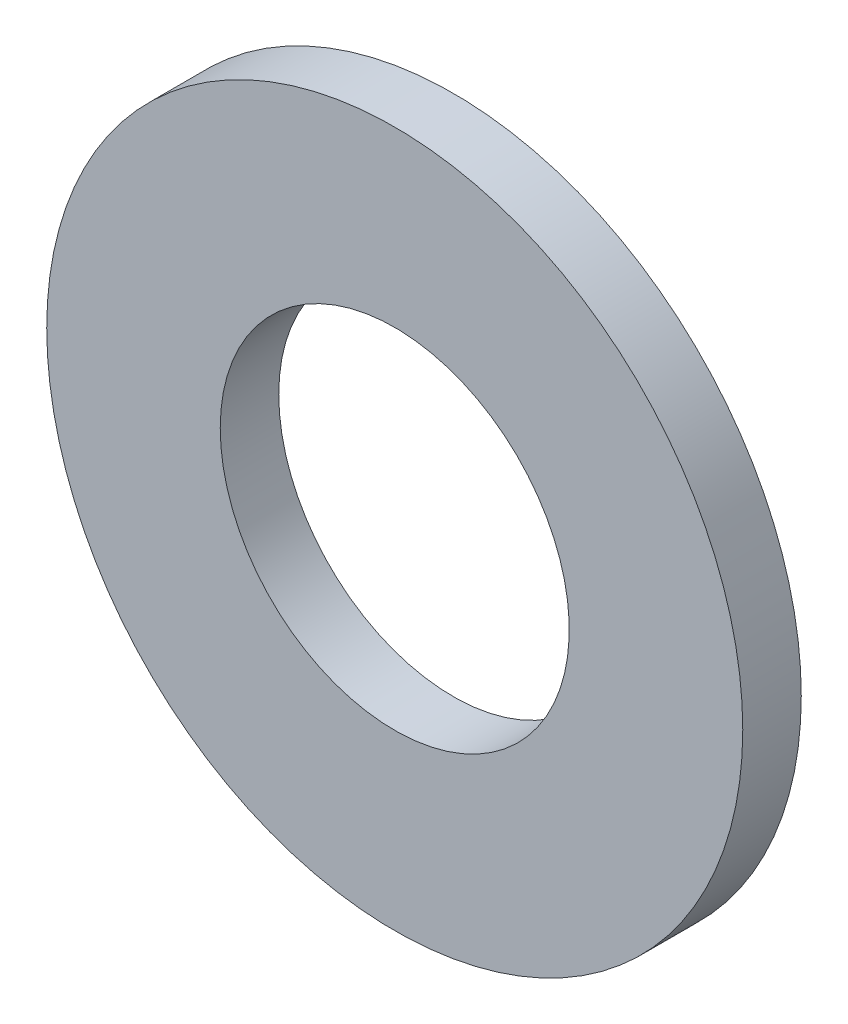
ISO-10303-21;
HEADER;
FILE_DESCRIPTION(('STEP AP214'),'2;1');
FILE_NAME('part.step','',(''),(''),'','','');
FILE_SCHEMA(('AUTOMOTIVE_DESIGN { 1 0 10303 214 1 1 1 1 }'));
ENDSEC;
DATA;
#1=APPLICATION_CONTEXT('core data for automotive mechanical design processes');
#2=APPLICATION_PROTOCOL_DEFINITION('international standard','automotive_design',2000,#1);
#3=PRODUCT_CONTEXT('',#1,'mechanical');
#4=PRODUCT('Part','Part','',(#3));
#5=PRODUCT_RELATED_PRODUCT_CATEGORY('part','',(#4));
#6=PRODUCT_DEFINITION_FORMATION('','',#4);
#7=PRODUCT_DEFINITION_CONTEXT('part definition',#1,'design');
#8=PRODUCT_DEFINITION('design','',#6,#7);
#9=PRODUCT_DEFINITION_SHAPE('','',#8);
#10=(LENGTH_UNIT() NAMED_UNIT(*) SI_UNIT(.MILLI.,.METRE.));
#11=(NAMED_UNIT(*) PLANE_ANGLE_UNIT() SI_UNIT($,.RADIAN.));
#12=(NAMED_UNIT(*) SI_UNIT($,.STERADIAN.) SOLID_ANGLE_UNIT());
#13=UNCERTAINTY_MEASURE_WITH_UNIT(LENGTH_MEASURE(1.E-05),#10,'distance_accuracy_value','');
#14=(GEOMETRIC_REPRESENTATION_CONTEXT(3) GLOBAL_UNCERTAINTY_ASSIGNED_CONTEXT((#13)) GLOBAL_UNIT_ASSIGNED_CONTEXT((#10,
#11,#12)) REPRESENTATION_CONTEXT('',''));
#15=CARTESIAN_POINT('',(0.,0.,0.));
#16=DIRECTION('',(0.,0.,1.));
#17=DIRECTION('',(1.,0.,0.));
#18=AXIS2_PLACEMENT_3D('',#15,#16,#17);
#19=CARTESIAN_POINT('',(0.,0.,0.));
#20=DIRECTION('',(0.,0.,-1.));
#21=DIRECTION('',(-1.,0.,0.));
#22=AXIS2_PLACEMENT_3D('',#19,#20,#21);
#23=PLANE('',#22);
#24=CARTESIAN_POINT('',(0.,0.,0.));
#25=DIRECTION('',(0.,0.,-1.));
#26=DIRECTION('',(-1.,0.,0.));
#27=AXIS2_PLACEMENT_3D('',#24,#25,#26);
#28=CIRCLE('',#27,8.763);
#29=CARTESIAN_POINT('',(-8.763,0.,0.));
#30=VERTEX_POINT('',#29);
#31=EDGE_CURVE('E31',#30,#30,#28,.F.);
#32=ORIENTED_EDGE('',*,*,#31,.F.);
#33=EDGE_LOOP('',(#32));
#34=FACE_BOUND('',#33,.T.);
#35=CARTESIAN_POINT('',(0.,0.,0.));
#36=DIRECTION('',(0.,0.,-1.));
#37=DIRECTION('',(-1.,0.,0.));
#38=AXIS2_PLACEMENT_3D('',#35,#36,#37);
#39=CIRCLE('',#38,4.3942);
#40=CARTESIAN_POINT('',(-4.3942,0.,0.));
#41=VERTEX_POINT('',#40);
#42=EDGE_CURVE('E17',#41,#41,#39,.F.);
#43=ORIENTED_EDGE('',*,*,#42,.T.);
#44=EDGE_LOOP('',(#43));
#45=FACE_BOUND('',#44,.T.);
#46=ADVANCED_FACE('F14',(#34,#45),#23,.T.);
#47=CARTESIAN_POINT('',(0.,0.,1.4732));
#48=DIRECTION('',(0.,0.,-1.));
#49=DIRECTION('',(-1.,0.,0.));
#50=AXIS2_PLACEMENT_3D('',#47,#48,#49);
#51=CYLINDRICAL_SURFACE('',#50,4.3942);
#52=CARTESIAN_POINT('',(0.,0.,1.4732));
#53=DIRECTION('',(0.,0.,-1.));
#54=DIRECTION('',(-1.,0.,0.));
#55=AXIS2_PLACEMENT_3D('',#52,#53,#54);
#56=CIRCLE('',#55,4.3942);
#57=CARTESIAN_POINT('',(-4.3942,0.,1.4732));
#58=VERTEX_POINT('',#57);
#59=EDGE_CURVE('E22',#58,#58,#56,.F.);
#60=ORIENTED_EDGE('',*,*,#59,.T.);
#61=EDGE_LOOP('',(#60));
#62=FACE_BOUND('',#61,.T.);
#63=ORIENTED_EDGE('',*,*,#42,.F.);
#64=EDGE_LOOP('',(#63));
#65=FACE_BOUND('',#64,.T.);
#66=ADVANCED_FACE('F40',(#62,#65),#51,.F.);
#67=CARTESIAN_POINT('',(0.,0.,1.4732));
#68=DIRECTION('',(0.,0.,-1.));
#69=DIRECTION('',(-1.,0.,0.));
#70=AXIS2_PLACEMENT_3D('',#67,#68,#69);
#71=CYLINDRICAL_SURFACE('',#70,8.763);
#72=ORIENTED_EDGE('',*,*,#31,.T.);
#73=EDGE_LOOP('',(#72));
#74=FACE_BOUND('',#73,.T.);
#75=CARTESIAN_POINT('',(0.,0.,1.4732));
#76=DIRECTION('',(0.,0.,-1.));
#77=DIRECTION('',(-1.,0.,0.));
#78=AXIS2_PLACEMENT_3D('',#75,#76,#77);
#79=CIRCLE('',#78,8.763);
#80=CARTESIAN_POINT('',(-8.763,0.,1.4732));
#81=VERTEX_POINT('',#80);
#82=EDGE_CURVE('E10',#81,#81,#79,.T.);
#83=ORIENTED_EDGE('',*,*,#82,.T.);
#84=EDGE_LOOP('',(#83));
#85=FACE_BOUND('',#84,.T.);
#86=ADVANCED_FACE('F42',(#74,#85),#71,.T.);
#87=CARTESIAN_POINT('',(0.,0.,1.4732));
#88=DIRECTION('',(0.,0.,-1.));
#89=DIRECTION('',(-1.,0.,0.));
#90=AXIS2_PLACEMENT_3D('',#87,#88,#89);
#91=PLANE('',#90);
#92=ORIENTED_EDGE('',*,*,#82,.F.);
#93=EDGE_LOOP('',(#92));
#94=FACE_BOUND('',#93,.T.);
#95=ORIENTED_EDGE('',*,*,#59,.F.);
#96=EDGE_LOOP('',(#95));
#97=FACE_BOUND('',#96,.T.);
#98=ADVANCED_FACE('F49',(#94,#97),#91,.F.);
#99=CLOSED_SHELL('',(#46,#66,#86,#98));
#100=MANIFOLD_SOLID_BREP('B1',#99);
#101=ADVANCED_BREP_SHAPE_REPRESENTATION('',(#18,#100),#14);
#102=SHAPE_DEFINITION_REPRESENTATION(#9,#101);
ENDSEC;
END-ISO-10303-21;
